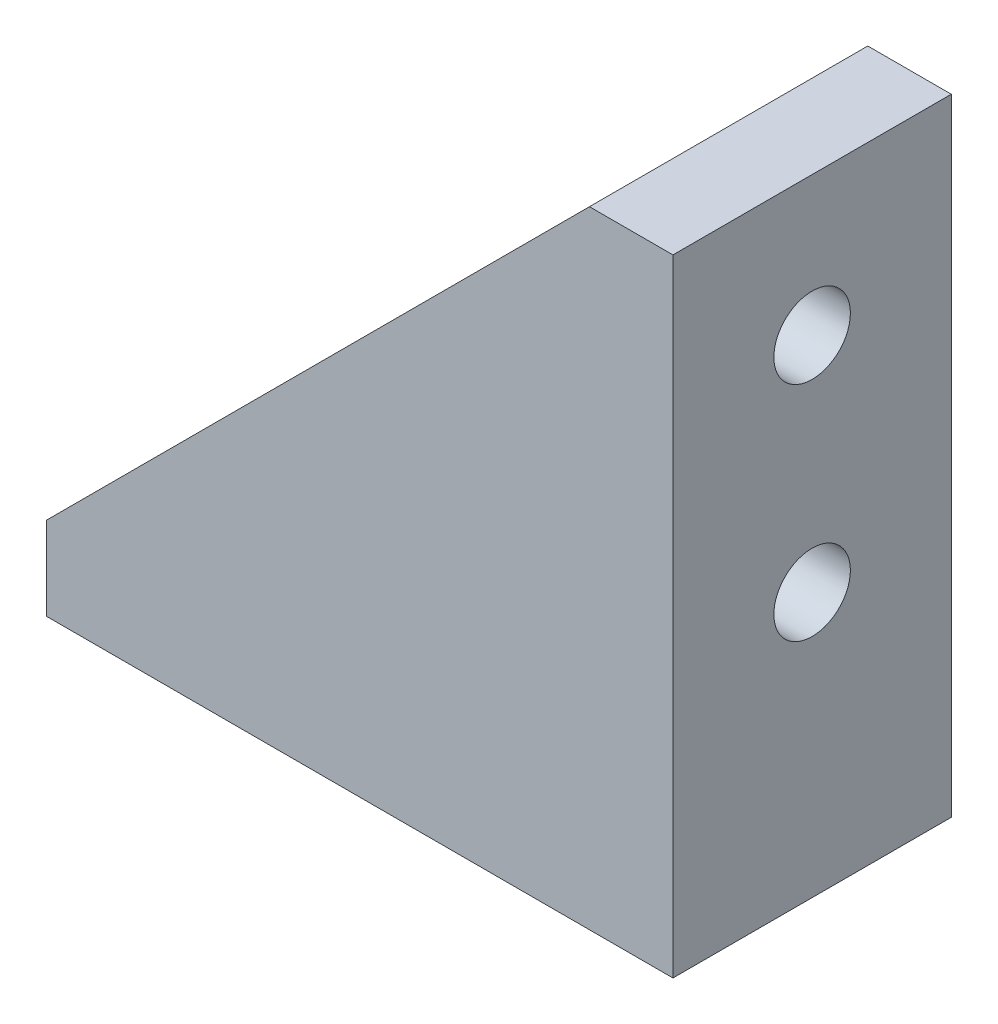
ISO-10303-21;
HEADER;
FILE_DESCRIPTION(('STEP AP214'),'2;1');
FILE_NAME('part.step','',(''),(''),'','','');
FILE_SCHEMA(('AUTOMOTIVE_DESIGN { 1 0 10303 214 1 1 1 1 }'));
ENDSEC;
DATA;
#1=APPLICATION_CONTEXT('core data for automotive mechanical design processes');
#2=APPLICATION_PROTOCOL_DEFINITION('international standard','automotive_design',2000,#1);
#3=PRODUCT_CONTEXT('',#1,'mechanical');
#4=PRODUCT('Part','Part','',(#3));
#5=PRODUCT_RELATED_PRODUCT_CATEGORY('part','',(#4));
#6=PRODUCT_DEFINITION_FORMATION('','',#4);
#7=PRODUCT_DEFINITION_CONTEXT('part definition',#1,'design');
#8=PRODUCT_DEFINITION('design','',#6,#7);
#9=PRODUCT_DEFINITION_SHAPE('','',#8);
#10=(LENGTH_UNIT() NAMED_UNIT(*) SI_UNIT(.MILLI.,.METRE.));
#11=(NAMED_UNIT(*) PLANE_ANGLE_UNIT() SI_UNIT($,.RADIAN.));
#12=(NAMED_UNIT(*) SI_UNIT($,.STERADIAN.) SOLID_ANGLE_UNIT());
#13=UNCERTAINTY_MEASURE_WITH_UNIT(LENGTH_MEASURE(1.E-05),#10,'distance_accuracy_value','');
#14=(GEOMETRIC_REPRESENTATION_CONTEXT(3) GLOBAL_UNCERTAINTY_ASSIGNED_CONTEXT((#13)) GLOBAL_UNIT_ASSIGNED_CONTEXT((#10,
#11,#12)) REPRESENTATION_CONTEXT('',''));
#15=CARTESIAN_POINT('',(0.,0.,0.));
#16=DIRECTION('',(0.,0.,1.));
#17=DIRECTION('',(1.,0.,0.));
#18=AXIS2_PLACEMENT_3D('',#15,#16,#17);
#19=CARTESIAN_POINT('',(39.,45.,20.));
#20=DIRECTION('',(0.707106781186547,-0.707106781186548,0.));
#21=DIRECTION('',(0.707106781186548,0.707106781186547,0.));
#22=AXIS2_PLACEMENT_3D('',#19,#20,#21);
#23=PLANE('',#22);
#24=DIRECTION('',(0.,0.,-1.));
#25=VECTOR('',#24,1.);
#26=CARTESIAN_POINT('',(39.,45.,20.));
#27=LINE('',#26,#25);
#28=CARTESIAN_POINT('',(39.,45.,20.));
#29=VERTEX_POINT('',#28);
#30=CARTESIAN_POINT('',(39.,45.,16.));
#31=VERTEX_POINT('',#30);
#32=EDGE_CURVE('E122',#29,#31,#27,.T.);
#33=ORIENTED_EDGE('',*,*,#32,.T.);
#34=DIRECTION('',(-0.707106781186548,-0.707106781186547,0.));
#35=VECTOR('',#34,1.);
#36=CARTESIAN_POINT('',(39.,45.,16.));
#37=LINE('',#36,#35);
#38=CARTESIAN_POINT('',(0.,6.,16.));
#39=VERTEX_POINT('',#38);
#40=EDGE_CURVE('E11',#31,#39,#37,.T.);
#41=ORIENTED_EDGE('',*,*,#40,.T.);
#42=DIRECTION('',(0.,0.,-1.));
#43=VECTOR('',#42,1.);
#44=CARTESIAN_POINT('',(0.,6.,20.));
#45=LINE('',#44,#43);
#46=CARTESIAN_POINT('',(0.,6.,20.));
#47=VERTEX_POINT('',#46);
#48=EDGE_CURVE('E142',#47,#39,#45,.T.);
#49=ORIENTED_EDGE('',*,*,#48,.F.);
#50=DIRECTION('',(-0.707106781186548,-0.707106781186547,0.));
#51=VECTOR('',#50,1.);
#52=CARTESIAN_POINT('',(39.,45.,20.));
#53=LINE('',#52,#51);
#54=EDGE_CURVE('E63',#29,#47,#53,.T.);
#55=ORIENTED_EDGE('',*,*,#54,.F.);
#56=EDGE_LOOP('',(#33,#41,#49,#55));
#57=FACE_BOUND('',#56,.T.);
#58=ADVANCED_FACE('F39',(#57),#23,.F.);
#59=CARTESIAN_POINT('',(0.,6.,20.));
#60=DIRECTION('',(1.,0.,0.));
#61=DIRECTION('',(0.,1.,0.));
#62=AXIS2_PLACEMENT_3D('',#59,#60,#61);
#63=PLANE('',#62);
#64=DIRECTION('',(0.,-1.,0.));
#65=VECTOR('',#64,1.);
#66=CARTESIAN_POINT('',(0.,6.,0.));
#67=LINE('',#66,#65);
#68=CARTESIAN_POINT('',(0.,6.,0.));
#69=VERTEX_POINT('',#68);
#70=CARTESIAN_POINT('',(0.,0.,0.));
#71=VERTEX_POINT('',#70);
#72=EDGE_CURVE('E131',#69,#71,#67,.T.);
#73=ORIENTED_EDGE('',*,*,#72,.T.);
#74=DIRECTION('',(0.,0.,-1.));
#75=VECTOR('',#74,1.);
#76=CARTESIAN_POINT('',(0.,0.,20.));
#77=LINE('',#76,#75);
#78=CARTESIAN_POINT('',(0.,0.,20.));
#79=VERTEX_POINT('',#78);
#80=EDGE_CURVE('E148',#79,#71,#77,.T.);
#81=ORIENTED_EDGE('',*,*,#80,.F.);
#82=DIRECTION('',(0.,-1.,0.));
#83=VECTOR('',#82,1.);
#84=CARTESIAN_POINT('',(0.,6.,20.));
#85=LINE('',#84,#83);
#86=EDGE_CURVE('E141',#47,#79,#85,.T.);
#87=ORIENTED_EDGE('',*,*,#86,.F.);
#88=ORIENTED_EDGE('',*,*,#48,.T.);
#89=DIRECTION('',(0.,0.,1.));
#90=VECTOR('',#89,1.);
#91=CARTESIAN_POINT('',(0.,6.,16.));
#92=LINE('',#91,#90);
#93=CARTESIAN_POINT('',(0.,6.,4.));
#94=VERTEX_POINT('',#93);
#95=EDGE_CURVE('E323',#94,#39,#92,.T.);
#96=ORIENTED_EDGE('',*,*,#95,.F.);
#97=EDGE_CURVE('E88',#94,#69,#45,.T.);
#98=ORIENTED_EDGE('',*,*,#97,.T.);
#99=EDGE_LOOP('',(#73,#81,#87,#88,#96,#98));
#100=FACE_BOUND('',#99,.T.);
#101=ADVANCED_FACE('F41',(#100),#63,.F.);
#102=CARTESIAN_POINT('',(0.,0.,20.));
#103=DIRECTION('',(0.,1.,0.));
#104=DIRECTION('',(0.,0.,1.));
#105=AXIS2_PLACEMENT_3D('',#102,#103,#104);
#106=PLANE('',#105);
#107=CARTESIAN_POINT('',(10.,0.,10.));
#108=DIRECTION('',(0.,-1.,0.));
#109=DIRECTION('',(0.,0.,-1.));
#110=AXIS2_PLACEMENT_3D('',#107,#108,#109);
#111=CIRCLE('',#110,2.75);
#112=CARTESIAN_POINT('',(10.,0.,7.25));
#113=VERTEX_POINT('',#112);
#114=EDGE_CURVE('E357',#113,#113,#111,.T.);
#115=ORIENTED_EDGE('',*,*,#114,.F.);
#116=EDGE_LOOP('',(#115));
#117=FACE_BOUND('',#116,.T.);
#118=CARTESIAN_POINT('',(26.,0.,10.));
#119=DIRECTION('',(0.,-1.,0.));
#120=DIRECTION('',(0.,0.,-1.));
#121=AXIS2_PLACEMENT_3D('',#118,#119,#120);
#122=CIRCLE('',#121,2.75);
#123=CARTESIAN_POINT('',(26.,0.,7.25));
#124=VERTEX_POINT('',#123);
#125=EDGE_CURVE('E360',#124,#124,#122,.T.);
#126=ORIENTED_EDGE('',*,*,#125,.F.);
#127=EDGE_LOOP('',(#126));
#128=FACE_BOUND('',#127,.T.);
#129=DIRECTION('',(1.,0.,0.));
#130=VECTOR('',#129,1.);
#131=CARTESIAN_POINT('',(0.,0.,0.));
#132=LINE('',#131,#130);
#133=CARTESIAN_POINT('',(45.,0.,0.));
#134=VERTEX_POINT('',#133);
#135=EDGE_CURVE('E133',#71,#134,#132,.T.);
#136=ORIENTED_EDGE('',*,*,#135,.T.);
#137=DIRECTION('',(0.,0.,-1.));
#138=VECTOR('',#137,1.);
#139=CARTESIAN_POINT('',(45.,0.,20.));
#140=LINE('',#139,#138);
#141=CARTESIAN_POINT('',(45.,0.,20.));
#142=VERTEX_POINT('',#141);
#143=EDGE_CURVE('E121',#142,#134,#140,.T.);
#144=ORIENTED_EDGE('',*,*,#143,.F.);
#145=DIRECTION('',(1.,0.,0.));
#146=VECTOR('',#145,1.);
#147=CARTESIAN_POINT('',(0.,0.,20.));
#148=LINE('',#147,#146);
#149=EDGE_CURVE('E97',#79,#142,#148,.T.);
#150=ORIENTED_EDGE('',*,*,#149,.F.);
#151=ORIENTED_EDGE('',*,*,#80,.T.);
#152=EDGE_LOOP('',(#136,#144,#150,#151));
#153=FACE_BOUND('',#152,.T.);
#154=ADVANCED_FACE('F167',(#117,#128,#153),#106,.F.);
#155=CARTESIAN_POINT('',(45.,0.,20.));
#156=DIRECTION('',(-1.,0.,0.));
#157=DIRECTION('',(0.,0.,1.));
#158=AXIS2_PLACEMENT_3D('',#155,#156,#157);
#159=PLANE('',#158);
#160=CARTESIAN_POINT('',(45.,35.,10.));
#161=DIRECTION('',(1.,0.,0.));
#162=DIRECTION('',(0.,0.,-1.));
#163=AXIS2_PLACEMENT_3D('',#160,#161,#162);
#164=CIRCLE('',#163,2.75);
#165=CARTESIAN_POINT('',(45.,35.,7.25));
#166=VERTEX_POINT('',#165);
#167=EDGE_CURVE('E337',#166,#166,#164,.T.);
#168=ORIENTED_EDGE('',*,*,#167,.F.);
#169=EDGE_LOOP('',(#168));
#170=FACE_BOUND('',#169,.T.);
#171=CARTESIAN_POINT('',(45.,19.,10.));
#172=DIRECTION('',(1.,0.,0.));
#173=DIRECTION('',(0.,0.,-1.));
#174=AXIS2_PLACEMENT_3D('',#171,#172,#173);
#175=CIRCLE('',#174,2.75);
#176=CARTESIAN_POINT('',(45.,19.,7.25));
#177=VERTEX_POINT('',#176);
#178=EDGE_CURVE('E342',#177,#177,#175,.T.);
#179=ORIENTED_EDGE('',*,*,#178,.F.);
#180=EDGE_LOOP('',(#179));
#181=FACE_BOUND('',#180,.T.);
#182=DIRECTION('',(0.,1.,0.));
#183=VECTOR('',#182,1.);
#184=CARTESIAN_POINT('',(45.,0.,0.));
#185=LINE('',#184,#183);
#186=CARTESIAN_POINT('',(45.,45.,0.));
#187=VERTEX_POINT('',#186);
#188=EDGE_CURVE('E117',#134,#187,#185,.T.);
#189=ORIENTED_EDGE('',*,*,#188,.T.);
#190=DIRECTION('',(0.,0.,-1.));
#191=VECTOR('',#190,1.);
#192=CARTESIAN_POINT('',(45.,45.,20.));
#193=LINE('',#192,#191);
#194=CARTESIAN_POINT('',(45.,45.,20.));
#195=VERTEX_POINT('',#194);
#196=EDGE_CURVE('E114',#195,#187,#193,.T.);
#197=ORIENTED_EDGE('',*,*,#196,.F.);
#198=DIRECTION('',(0.,1.,0.));
#199=VECTOR('',#198,1.);
#200=CARTESIAN_POINT('',(45.,0.,20.));
#201=LINE('',#200,#199);
#202=EDGE_CURVE('E104',#142,#195,#201,.T.);
#203=ORIENTED_EDGE('',*,*,#202,.F.);
#204=ORIENTED_EDGE('',*,*,#143,.T.);
#205=EDGE_LOOP('',(#189,#197,#203,#204));
#206=FACE_BOUND('',#205,.T.);
#207=ADVANCED_FACE('F115',(#170,#181,#206),#159,.F.);
#208=CARTESIAN_POINT('',(45.,45.,20.));
#209=DIRECTION('',(0.,-1.,0.));
#210=DIRECTION('',(1.,0.,0.));
#211=AXIS2_PLACEMENT_3D('',#208,#209,#210);
#212=PLANE('',#211);
#213=DIRECTION('',(-1.,0.,0.));
#214=VECTOR('',#213,1.);
#215=CARTESIAN_POINT('',(45.,45.,0.));
#216=LINE('',#215,#214);
#217=CARTESIAN_POINT('',(39.,45.,0.));
#218=VERTEX_POINT('',#217);
#219=EDGE_CURVE('E137',#187,#218,#216,.T.);
#220=ORIENTED_EDGE('',*,*,#219,.T.);
#221=CARTESIAN_POINT('',(39.,45.,4.));
#222=VERTEX_POINT('',#221);
#223=EDGE_CURVE('E145',#222,#218,#27,.T.);
#224=ORIENTED_EDGE('',*,*,#223,.F.);
#225=DIRECTION('',(0.,0.,-1.));
#226=VECTOR('',#225,1.);
#227=CARTESIAN_POINT('',(39.,45.,16.));
#228=LINE('',#227,#226);
#229=EDGE_CURVE('E160',#31,#222,#228,.T.);
#230=ORIENTED_EDGE('',*,*,#229,.F.);
#231=ORIENTED_EDGE('',*,*,#32,.F.);
#232=DIRECTION('',(-1.,0.,0.));
#233=VECTOR('',#232,1.);
#234=CARTESIAN_POINT('',(45.,45.,20.));
#235=LINE('',#234,#233);
#236=EDGE_CURVE('E108',#195,#29,#235,.T.);
#237=ORIENTED_EDGE('',*,*,#236,.F.);
#238=ORIENTED_EDGE('',*,*,#196,.T.);
#239=EDGE_LOOP('',(#220,#224,#230,#231,#237,#238));
#240=FACE_BOUND('',#239,.T.);
#241=ADVANCED_FACE('F124',(#240),#212,.F.);
#242=ORIENTED_EDGE('',*,*,#97,.F.);
#243=DIRECTION('',(0.707106781186548,0.707106781186547,0.));
#244=VECTOR('',#243,1.);
#245=CARTESIAN_POINT('',(39.,45.,4.));
#246=LINE('',#245,#244);
#247=EDGE_CURVE('E47',#94,#222,#246,.T.);
#248=ORIENTED_EDGE('',*,*,#247,.T.);
#249=ORIENTED_EDGE('',*,*,#223,.T.);
#250=DIRECTION('',(-0.707106781186548,-0.707106781186547,0.));
#251=VECTOR('',#250,1.);
#252=CARTESIAN_POINT('',(39.,45.,0.));
#253=LINE('',#252,#251);
#254=EDGE_CURVE('E139',#218,#69,#253,.T.);
#255=ORIENTED_EDGE('',*,*,#254,.T.);
#256=EDGE_LOOP('',(#242,#248,#249,#255));
#257=FACE_BOUND('',#256,.T.);
#258=ADVANCED_FACE('F153',(#257),#23,.F.);
#259=CARTESIAN_POINT('',(0.,0.,20.));
#260=DIRECTION('',(0.,0.,1.));
#261=DIRECTION('',(1.,0.,0.));
#262=AXIS2_PLACEMENT_3D('',#259,#260,#261);
#263=PLANE('',#262);
#264=ORIENTED_EDGE('',*,*,#86,.T.);
#265=ORIENTED_EDGE('',*,*,#149,.T.);
#266=ORIENTED_EDGE('',*,*,#202,.T.);
#267=ORIENTED_EDGE('',*,*,#236,.T.);
#268=ORIENTED_EDGE('',*,*,#54,.T.);
#269=EDGE_LOOP('',(#264,#265,#266,#267,#268));
#270=FACE_BOUND('',#269,.T.);
#271=ADVANCED_FACE('F106',(#270),#263,.T.);
#272=CARTESIAN_POINT('',(0.,0.,0.));
#273=DIRECTION('',(0.,0.,1.));
#274=DIRECTION('',(1.,0.,0.));
#275=AXIS2_PLACEMENT_3D('',#272,#273,#274);
#276=PLANE('',#275);
#277=ORIENTED_EDGE('',*,*,#72,.F.);
#278=ORIENTED_EDGE('',*,*,#254,.F.);
#279=ORIENTED_EDGE('',*,*,#219,.F.);
#280=ORIENTED_EDGE('',*,*,#188,.F.);
#281=ORIENTED_EDGE('',*,*,#135,.F.);
#282=EDGE_LOOP('',(#277,#278,#279,#280,#281));
#283=FACE_BOUND('',#282,.T.);
#284=ADVANCED_FACE('F164',(#283),#276,.F.);
#285=CARTESIAN_POINT('',(39.,45.,16.));
#286=DIRECTION('',(0.,0.,1.));
#287=DIRECTION('',(0.,-1.,0.));
#288=AXIS2_PLACEMENT_3D('',#285,#286,#287);
#289=PLANE('',#288);
#290=DIRECTION('',(0.,1.,0.));
#291=VECTOR('',#290,1.);
#292=CARTESIAN_POINT('',(39.,45.,16.));
#293=LINE('',#292,#291);
#294=CARTESIAN_POINT('',(39.,6.,16.));
#295=VERTEX_POINT('',#294);
#296=EDGE_CURVE('E319',#295,#31,#293,.T.);
#297=ORIENTED_EDGE('',*,*,#296,.F.);
#298=DIRECTION('',(-1.,0.,0.));
#299=VECTOR('',#298,1.);
#300=CARTESIAN_POINT('',(39.,6.,16.));
#301=LINE('',#300,#299);
#302=EDGE_CURVE('E134',#295,#39,#301,.T.);
#303=ORIENTED_EDGE('',*,*,#302,.T.);
#304=ORIENTED_EDGE('',*,*,#40,.F.);
#305=EDGE_LOOP('',(#297,#303,#304));
#306=FACE_BOUND('',#305,.T.);
#307=ADVANCED_FACE('F275',(#306),#289,.F.);
#308=CARTESIAN_POINT('',(39.,45.,4.));
#309=DIRECTION('',(0.,0.,-1.));
#310=DIRECTION('',(0.,1.,0.));
#311=AXIS2_PLACEMENT_3D('',#308,#309,#310);
#312=PLANE('',#311);
#313=DIRECTION('',(-1.,0.,0.));
#314=VECTOR('',#313,1.);
#315=CARTESIAN_POINT('',(39.,6.,4.));
#316=LINE('',#315,#314);
#317=CARTESIAN_POINT('',(39.,6.,4.));
#318=VERTEX_POINT('',#317);
#319=EDGE_CURVE('E54',#318,#94,#316,.T.);
#320=ORIENTED_EDGE('',*,*,#319,.F.);
#321=DIRECTION('',(0.,-1.,0.));
#322=VECTOR('',#321,1.);
#323=CARTESIAN_POINT('',(39.,45.,4.));
#324=LINE('',#323,#322);
#325=EDGE_CURVE('E327',#222,#318,#324,.T.);
#326=ORIENTED_EDGE('',*,*,#325,.F.);
#327=ORIENTED_EDGE('',*,*,#247,.F.);
#328=EDGE_LOOP('',(#320,#326,#327));
#329=FACE_BOUND('',#328,.T.);
#330=ADVANCED_FACE('F218',(#329),#312,.F.);
#331=CARTESIAN_POINT('',(39.,6.,16.));
#332=DIRECTION('',(0.,-1.,0.));
#333=DIRECTION('',(1.,0.,0.));
#334=AXIS2_PLACEMENT_3D('',#331,#332,#333);
#335=PLANE('',#334);
#336=CARTESIAN_POINT('',(10.,6.,10.));
#337=DIRECTION('',(0.,-1.,0.));
#338=DIRECTION('',(1.,0.,0.));
#339=AXIS2_PLACEMENT_3D('',#336,#337,#338);
#340=CIRCLE('',#339,2.75);
#341=CARTESIAN_POINT('',(12.75,6.,10.));
#342=VERTEX_POINT('',#341);
#343=EDGE_CURVE('E349',#342,#342,#340,.F.);
#344=ORIENTED_EDGE('',*,*,#343,.F.);
#345=EDGE_LOOP('',(#344));
#346=FACE_BOUND('',#345,.T.);
#347=CARTESIAN_POINT('',(26.,6.,10.));
#348=DIRECTION('',(0.,-1.,0.));
#349=DIRECTION('',(1.,0.,0.));
#350=AXIS2_PLACEMENT_3D('',#347,#348,#349);
#351=CIRCLE('',#350,2.75);
#352=CARTESIAN_POINT('',(28.75,6.,10.));
#353=VERTEX_POINT('',#352);
#354=EDGE_CURVE('E363',#353,#353,#351,.F.);
#355=ORIENTED_EDGE('',*,*,#354,.F.);
#356=EDGE_LOOP('',(#355));
#357=FACE_BOUND('',#356,.T.);
#358=ORIENTED_EDGE('',*,*,#95,.T.);
#359=ORIENTED_EDGE('',*,*,#302,.F.);
#360=DIRECTION('',(0.,0.,1.));
#361=VECTOR('',#360,1.);
#362=CARTESIAN_POINT('',(39.,6.,16.));
#363=LINE('',#362,#361);
#364=EDGE_CURVE('E326',#318,#295,#363,.T.);
#365=ORIENTED_EDGE('',*,*,#364,.F.);
#366=ORIENTED_EDGE('',*,*,#319,.T.);
#367=EDGE_LOOP('',(#358,#359,#365,#366));
#368=FACE_BOUND('',#367,.T.);
#369=ADVANCED_FACE('F226',(#346,#357,#368),#335,.F.);
#370=CARTESIAN_POINT('',(39.,0.,0.));
#371=DIRECTION('',(1.,0.,0.));
#372=DIRECTION('',(0.,1.,0.));
#373=AXIS2_PLACEMENT_3D('',#370,#371,#372);
#374=PLANE('',#373);
#375=CARTESIAN_POINT('',(39.,35.,10.));
#376=DIRECTION('',(1.,0.,0.));
#377=DIRECTION('',(0.,1.,0.));
#378=AXIS2_PLACEMENT_3D('',#375,#376,#377);
#379=CIRCLE('',#378,2.75);
#380=CARTESIAN_POINT('',(39.,37.75,10.));
#381=VERTEX_POINT('',#380);
#382=EDGE_CURVE('E334',#381,#381,#379,.F.);
#383=ORIENTED_EDGE('',*,*,#382,.F.);
#384=EDGE_LOOP('',(#383));
#385=FACE_BOUND('',#384,.T.);
#386=CARTESIAN_POINT('',(39.,19.,10.));
#387=DIRECTION('',(1.,0.,0.));
#388=DIRECTION('',(0.,1.,0.));
#389=AXIS2_PLACEMENT_3D('',#386,#387,#388);
#390=CIRCLE('',#389,2.75);
#391=CARTESIAN_POINT('',(39.,21.75,10.));
#392=VERTEX_POINT('',#391);
#393=EDGE_CURVE('E346',#392,#392,#390,.F.);
#394=ORIENTED_EDGE('',*,*,#393,.F.);
#395=EDGE_LOOP('',(#394));
#396=FACE_BOUND('',#395,.T.);
#397=ORIENTED_EDGE('',*,*,#296,.T.);
#398=ORIENTED_EDGE('',*,*,#229,.T.);
#399=ORIENTED_EDGE('',*,*,#325,.T.);
#400=ORIENTED_EDGE('',*,*,#364,.T.);
#401=EDGE_LOOP('',(#397,#398,#399,#400));
#402=FACE_BOUND('',#401,.T.);
#403=ADVANCED_FACE('F221',(#385,#396,#402),#374,.F.);
#404=CARTESIAN_POINT('',(-0.001000000000001,19.,10.));
#405=DIRECTION('',(1.,0.,0.));
#406=DIRECTION('',(0.,0.,-1.));
#407=AXIS2_PLACEMENT_3D('',#404,#405,#406);
#408=CYLINDRICAL_SURFACE('',#407,2.75);
#409=ORIENTED_EDGE('',*,*,#178,.T.);
#410=EDGE_LOOP('',(#409));
#411=FACE_BOUND('',#410,.T.);
#412=ORIENTED_EDGE('',*,*,#393,.T.);
#413=EDGE_LOOP('',(#412));
#414=FACE_BOUND('',#413,.T.);
#415=ADVANCED_FACE('F225',(#411,#414),#408,.F.);
#416=CARTESIAN_POINT('',(-0.001000000000001,35.,10.));
#417=DIRECTION('',(1.,0.,0.));
#418=DIRECTION('',(0.,0.,-1.));
#419=AXIS2_PLACEMENT_3D('',#416,#417,#418);
#420=CYLINDRICAL_SURFACE('',#419,2.75);
#421=ORIENTED_EDGE('',*,*,#167,.T.);
#422=EDGE_LOOP('',(#421));
#423=FACE_BOUND('',#422,.T.);
#424=ORIENTED_EDGE('',*,*,#382,.T.);
#425=EDGE_LOOP('',(#424));
#426=FACE_BOUND('',#425,.T.);
#427=ADVANCED_FACE('F235',(#423,#426),#420,.F.);
#428=CARTESIAN_POINT('',(26.,45.001,10.));
#429=DIRECTION('',(0.,-1.,0.));
#430=DIRECTION('',(0.,0.,-1.));
#431=AXIS2_PLACEMENT_3D('',#428,#429,#430);
#432=CYLINDRICAL_SURFACE('',#431,2.75);
#433=ORIENTED_EDGE('',*,*,#125,.T.);
#434=EDGE_LOOP('',(#433));
#435=FACE_BOUND('',#434,.T.);
#436=ORIENTED_EDGE('',*,*,#354,.T.);
#437=EDGE_LOOP('',(#436));
#438=FACE_BOUND('',#437,.T.);
#439=ADVANCED_FACE('F243',(#435,#438),#432,.F.);
#440=CARTESIAN_POINT('',(10.,45.001,10.));
#441=DIRECTION('',(0.,-1.,0.));
#442=DIRECTION('',(0.,0.,-1.));
#443=AXIS2_PLACEMENT_3D('',#440,#441,#442);
#444=CYLINDRICAL_SURFACE('',#443,2.75);
#445=ORIENTED_EDGE('',*,*,#114,.T.);
#446=EDGE_LOOP('',(#445));
#447=FACE_BOUND('',#446,.T.);
#448=ORIENTED_EDGE('',*,*,#343,.T.);
#449=EDGE_LOOP('',(#448));
#450=FACE_BOUND('',#449,.T.);
#451=ADVANCED_FACE('F256',(#447,#450),#444,.F.);
#452=CLOSED_SHELL('',(#58,#101,#154,#207,#241,#258,#271,#284,#307,#330,#369,#403,#415,#427,#439,#451));
#453=MANIFOLD_SOLID_BREP('B2',#452);
#454=ADVANCED_BREP_SHAPE_REPRESENTATION('',(#18,#453),#14);
#455=SHAPE_DEFINITION_REPRESENTATION(#9,#454);
ENDSEC;
END-ISO-10303-21;
